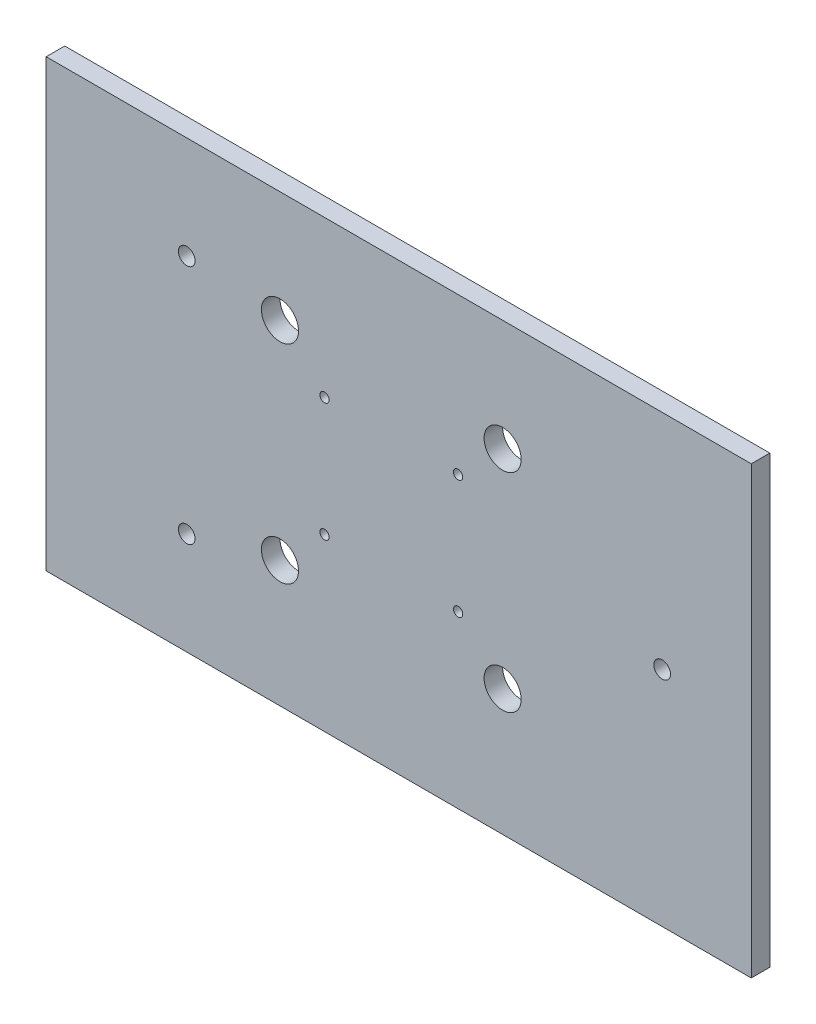
ISO-10303-21;
HEADER;
FILE_DESCRIPTION(('STEP AP214'),'2;1');
FILE_NAME('part.step','',(''),(''),'','','');
FILE_SCHEMA(('AUTOMOTIVE_DESIGN { 1 0 10303 214 1 1 1 1 }'));
ENDSEC;
DATA;
#1=APPLICATION_CONTEXT('core data for automotive mechanical design processes');
#2=APPLICATION_PROTOCOL_DEFINITION('international standard','automotive_design',2000,#1);
#3=PRODUCT_CONTEXT('',#1,'mechanical');
#4=PRODUCT('Part','Part','',(#3));
#5=PRODUCT_RELATED_PRODUCT_CATEGORY('part','',(#4));
#6=PRODUCT_DEFINITION_FORMATION('','',#4);
#7=PRODUCT_DEFINITION_CONTEXT('part definition',#1,'design');
#8=PRODUCT_DEFINITION('design','',#6,#7);
#9=PRODUCT_DEFINITION_SHAPE('','',#8);
#10=(LENGTH_UNIT() NAMED_UNIT(*) SI_UNIT(.MILLI.,.METRE.));
#11=(NAMED_UNIT(*) PLANE_ANGLE_UNIT() SI_UNIT($,.RADIAN.));
#12=(NAMED_UNIT(*) SI_UNIT($,.STERADIAN.) SOLID_ANGLE_UNIT());
#13=UNCERTAINTY_MEASURE_WITH_UNIT(LENGTH_MEASURE(1.E-05),#10,'distance_accuracy_value','');
#14=(GEOMETRIC_REPRESENTATION_CONTEXT(3) GLOBAL_UNCERTAINTY_ASSIGNED_CONTEXT((#13)) GLOBAL_UNIT_ASSIGNED_CONTEXT((#10,
#11,#12)) REPRESENTATION_CONTEXT('',''));
#15=CARTESIAN_POINT('',(0.,0.,0.));
#16=DIRECTION('',(0.,0.,1.));
#17=DIRECTION('',(1.,0.,0.));
#18=AXIS2_PLACEMENT_3D('',#15,#16,#17);
#19=CARTESIAN_POINT('',(0.,0.,5.));
#20=DIRECTION('',(0.,0.,-1.));
#21=DIRECTION('',(-1.,0.,0.));
#22=AXIS2_PLACEMENT_3D('',#19,#20,#21);
#23=PLANE('',#22);
#24=DIRECTION('',(0.,-1.,0.));
#25=VECTOR('',#24,1.);
#26=CARTESIAN_POINT('',(-129.499999999995,92.5000000000001,5.));
#27=LINE('',#26,#25);
#28=CARTESIAN_POINT('',(-129.499999999995,92.5000000000001,5.));
#29=VERTEX_POINT('',#28);
#30=CARTESIAN_POINT('',(-129.499999999995,-27.4999999999999,5.));
#31=VERTEX_POINT('',#30);
#32=EDGE_CURVE('E85',#29,#31,#27,.T.);
#33=ORIENTED_EDGE('',*,*,#32,.T.);
#34=DIRECTION('',(1.,0.,0.));
#35=VECTOR('',#34,1.);
#36=CARTESIAN_POINT('',(60.4999999999949,-27.4999999999992,5.));
#37=LINE('',#36,#35);
#38=CARTESIAN_POINT('',(60.4999999999949,-27.4999999999992,5.));
#39=VERTEX_POINT('',#38);
#40=EDGE_CURVE('E80',#31,#39,#37,.T.);
#41=ORIENTED_EDGE('',*,*,#40,.T.);
#42=DIRECTION('',(0.,1.,0.));
#43=VECTOR('',#42,1.);
#44=CARTESIAN_POINT('',(60.4999999999949,-27.4999999999992,5.));
#45=LINE('',#44,#43);
#46=CARTESIAN_POINT('',(60.4999999999942,92.5000000000007,5.));
#47=VERTEX_POINT('',#46);
#48=EDGE_CURVE('E83',#39,#47,#45,.T.);
#49=ORIENTED_EDGE('',*,*,#48,.T.);
#50=DIRECTION('',(-1.,0.,0.));
#51=VECTOR('',#50,1.);
#52=CARTESIAN_POINT('',(60.4999999999942,92.5000000000007,5.));
#53=LINE('',#52,#51);
#54=EDGE_CURVE('E50',#47,#29,#53,.T.);
#55=ORIENTED_EDGE('',*,*,#54,.T.);
#56=EDGE_LOOP('',(#33,#41,#49,#55));
#57=FACE_BOUND('',#56,.T.);
#58=CARTESIAN_POINT('',(36.4999999999996,32.5000000000007,5.));
#59=DIRECTION('',(0.,0.,1.));
#60=DIRECTION('',(1.,0.,0.));
#61=AXIS2_PLACEMENT_3D('',#58,#59,#60);
#62=CIRCLE('',#61,2.25000000000004);
#63=CARTESIAN_POINT('',(38.7499999999997,32.5000000000007,5.));
#64=VERTEX_POINT('',#63);
#65=EDGE_CURVE('E100',#64,#64,#62,.T.);
#66=ORIENTED_EDGE('',*,*,#65,.F.);
#67=EDGE_LOOP('',(#66));
#68=FACE_BOUND('',#67,.T.);
#69=CARTESIAN_POINT('',(-91.6231990769086,0.0692598560788349,5.));
#70=DIRECTION('',(0.,0.,1.));
#71=DIRECTION('',(1.,0.,0.));
#72=AXIS2_PLACEMENT_3D('',#69,#70,#71);
#73=CIRCLE('',#72,2.2500000000002);
#74=CARTESIAN_POINT('',(-89.3731990769084,0.0692598560788349,5.));
#75=VERTEX_POINT('',#74);
#76=EDGE_CURVE('E115',#75,#75,#73,.T.);
#77=ORIENTED_EDGE('',*,*,#76,.F.);
#78=EDGE_LOOP('',(#77));
#79=FACE_BOUND('',#78,.T.);
#80=CARTESIAN_POINT('',(-91.6231990769086,64.9307401439221,5.));
#81=DIRECTION('',(0.,0.,1.));
#82=DIRECTION('',(1.,0.,0.));
#83=AXIS2_PLACEMENT_3D('',#80,#81,#82);
#84=CIRCLE('',#83,2.24999999999967);
#85=CARTESIAN_POINT('',(-89.3731990769089,64.9307401439221,5.));
#86=VERTEX_POINT('',#85);
#87=EDGE_CURVE('E121',#86,#86,#84,.T.);
#88=ORIENTED_EDGE('',*,*,#87,.F.);
#89=EDGE_LOOP('',(#88));
#90=FACE_BOUND('',#89,.T.);
#91=CARTESIAN_POINT('',(-66.5,62.5,5.));
#92=DIRECTION('',(0.,0.,1.));
#93=DIRECTION('',(1.,0.,0.));
#94=AXIS2_PLACEMENT_3D('',#91,#92,#93);
#95=CIRCLE('',#94,5.);
#96=CARTESIAN_POINT('',(-61.5,62.5,5.));
#97=VERTEX_POINT('',#96);
#98=EDGE_CURVE('E127',#97,#97,#95,.T.);
#99=ORIENTED_EDGE('',*,*,#98,.F.);
#100=EDGE_LOOP('',(#99));
#101=FACE_BOUND('',#100,.T.);
#102=CARTESIAN_POINT('',(-6.5,62.5,5.));
#103=DIRECTION('',(0.,0.,1.));
#104=DIRECTION('',(1.,0.,0.));
#105=AXIS2_PLACEMENT_3D('',#102,#103,#104);
#106=CIRCLE('',#105,5.);
#107=CARTESIAN_POINT('',(-1.5,62.5,5.));
#108=VERTEX_POINT('',#107);
#109=EDGE_CURVE('E133',#108,#108,#106,.T.);
#110=ORIENTED_EDGE('',*,*,#109,.F.);
#111=EDGE_LOOP('',(#110));
#112=FACE_BOUND('',#111,.T.);
#113=CARTESIAN_POINT('',(-6.5,6.5,5.));
#114=DIRECTION('',(0.,0.,1.));
#115=DIRECTION('',(1.,0.,0.));
#116=AXIS2_PLACEMENT_3D('',#113,#114,#115);
#117=CIRCLE('',#116,5.);
#118=CARTESIAN_POINT('',(-1.5,6.5,5.));
#119=VERTEX_POINT('',#118);
#120=EDGE_CURVE('E139',#119,#119,#117,.T.);
#121=ORIENTED_EDGE('',*,*,#120,.F.);
#122=EDGE_LOOP('',(#121));
#123=FACE_BOUND('',#122,.T.);
#124=CARTESIAN_POINT('',(-66.5,6.5,5.));
#125=DIRECTION('',(0.,0.,1.));
#126=DIRECTION('',(1.,0.,0.));
#127=AXIS2_PLACEMENT_3D('',#124,#125,#126);
#128=CIRCLE('',#127,5.);
#129=CARTESIAN_POINT('',(-61.5,6.5,5.));
#130=VERTEX_POINT('',#129);
#131=EDGE_CURVE('E145',#130,#130,#128,.T.);
#132=ORIENTED_EDGE('',*,*,#131,.F.);
#133=EDGE_LOOP('',(#132));
#134=FACE_BOUND('',#133,.T.);
#135=CARTESIAN_POINT('',(-54.5,50.5,5.));
#136=DIRECTION('',(0.,0.,1.));
#137=DIRECTION('',(1.,0.,0.));
#138=AXIS2_PLACEMENT_3D('',#135,#136,#137);
#139=CIRCLE('',#138,1.25);
#140=CARTESIAN_POINT('',(-53.25,50.5,5.));
#141=VERTEX_POINT('',#140);
#142=EDGE_CURVE('E151',#141,#141,#139,.T.);
#143=ORIENTED_EDGE('',*,*,#142,.F.);
#144=EDGE_LOOP('',(#143));
#145=FACE_BOUND('',#144,.T.);
#146=CARTESIAN_POINT('',(-18.5,50.5,5.));
#147=DIRECTION('',(0.,0.,1.));
#148=DIRECTION('',(1.,0.,0.));
#149=AXIS2_PLACEMENT_3D('',#146,#147,#148);
#150=CIRCLE('',#149,1.25);
#151=CARTESIAN_POINT('',(-17.25,50.5,5.));
#152=VERTEX_POINT('',#151);
#153=EDGE_CURVE('E157',#152,#152,#150,.T.);
#154=ORIENTED_EDGE('',*,*,#153,.F.);
#155=EDGE_LOOP('',(#154));
#156=FACE_BOUND('',#155,.T.);
#157=CARTESIAN_POINT('',(-18.5,18.5,5.));
#158=DIRECTION('',(0.,0.,1.));
#159=DIRECTION('',(1.,0.,0.));
#160=AXIS2_PLACEMENT_3D('',#157,#158,#159);
#161=CIRCLE('',#160,1.25);
#162=CARTESIAN_POINT('',(-17.25,18.5,5.));
#163=VERTEX_POINT('',#162);
#164=EDGE_CURVE('E163',#163,#163,#161,.T.);
#165=ORIENTED_EDGE('',*,*,#164,.F.);
#166=EDGE_LOOP('',(#165));
#167=FACE_BOUND('',#166,.T.);
#168=CARTESIAN_POINT('',(-54.5,18.5,5.));
#169=DIRECTION('',(0.,0.,1.));
#170=DIRECTION('',(1.,0.,0.));
#171=AXIS2_PLACEMENT_3D('',#168,#169,#170);
#172=CIRCLE('',#171,1.25);
#173=CARTESIAN_POINT('',(-53.25,18.5,5.));
#174=VERTEX_POINT('',#173);
#175=EDGE_CURVE('E169',#174,#174,#172,.T.);
#176=ORIENTED_EDGE('',*,*,#175,.F.);
#177=EDGE_LOOP('',(#176));
#178=FACE_BOUND('',#177,.T.);
#179=ADVANCED_FACE('F33',(#57,#68,#79,#90,#101,#112,#123,#134,#145,#156,#167,#178),#23,.F.);
#180=CARTESIAN_POINT('',(0.,0.,0.));
#181=DIRECTION('',(0.,0.,-1.));
#182=DIRECTION('',(-1.,0.,0.));
#183=AXIS2_PLACEMENT_3D('',#180,#181,#182);
#184=PLANE('',#183);
#185=CARTESIAN_POINT('',(-18.5,18.5,0.));
#186=DIRECTION('',(0.,0.,1.));
#187=DIRECTION('',(1.,0.,0.));
#188=AXIS2_PLACEMENT_3D('',#185,#186,#187);
#189=CIRCLE('',#188,1.25);
#190=CARTESIAN_POINT('',(-17.25,18.5,0.));
#191=VERTEX_POINT('',#190);
#192=EDGE_CURVE('E166',#191,#191,#189,.T.);
#193=ORIENTED_EDGE('',*,*,#192,.T.);
#194=EDGE_LOOP('',(#193));
#195=FACE_BOUND('',#194,.T.);
#196=CARTESIAN_POINT('',(-54.5,50.5,0.));
#197=DIRECTION('',(0.,0.,1.));
#198=DIRECTION('',(1.,0.,0.));
#199=AXIS2_PLACEMENT_3D('',#196,#197,#198);
#200=CIRCLE('',#199,1.25);
#201=CARTESIAN_POINT('',(-53.25,50.5,0.));
#202=VERTEX_POINT('',#201);
#203=EDGE_CURVE('E154',#202,#202,#200,.T.);
#204=ORIENTED_EDGE('',*,*,#203,.T.);
#205=EDGE_LOOP('',(#204));
#206=FACE_BOUND('',#205,.T.);
#207=CARTESIAN_POINT('',(-6.5,6.5,0.));
#208=DIRECTION('',(0.,0.,1.));
#209=DIRECTION('',(1.,0.,0.));
#210=AXIS2_PLACEMENT_3D('',#207,#208,#209);
#211=CIRCLE('',#210,5.);
#212=CARTESIAN_POINT('',(-1.5,6.5,0.));
#213=VERTEX_POINT('',#212);
#214=EDGE_CURVE('E142',#213,#213,#211,.T.);
#215=ORIENTED_EDGE('',*,*,#214,.T.);
#216=EDGE_LOOP('',(#215));
#217=FACE_BOUND('',#216,.T.);
#218=CARTESIAN_POINT('',(-66.5,62.5,0.));
#219=DIRECTION('',(0.,0.,1.));
#220=DIRECTION('',(1.,0.,0.));
#221=AXIS2_PLACEMENT_3D('',#218,#219,#220);
#222=CIRCLE('',#221,5.);
#223=CARTESIAN_POINT('',(-61.5,62.5,0.));
#224=VERTEX_POINT('',#223);
#225=EDGE_CURVE('E130',#224,#224,#222,.T.);
#226=ORIENTED_EDGE('',*,*,#225,.T.);
#227=EDGE_LOOP('',(#226));
#228=FACE_BOUND('',#227,.T.);
#229=CARTESIAN_POINT('',(-91.6231990769086,0.0692598560788349,0.));
#230=DIRECTION('',(0.,0.,1.));
#231=DIRECTION('',(1.,0.,0.));
#232=AXIS2_PLACEMENT_3D('',#229,#230,#231);
#233=CIRCLE('',#232,2.2500000000002);
#234=CARTESIAN_POINT('',(-89.3731990769084,0.0692598560788349,0.));
#235=VERTEX_POINT('',#234);
#236=EDGE_CURVE('E118',#235,#235,#233,.T.);
#237=ORIENTED_EDGE('',*,*,#236,.T.);
#238=EDGE_LOOP('',(#237));
#239=FACE_BOUND('',#238,.T.);
#240=DIRECTION('',(0.,-1.,0.));
#241=VECTOR('',#240,1.);
#242=CARTESIAN_POINT('',(-129.499999999995,92.5000000000001,0.));
#243=LINE('',#242,#241);
#244=CARTESIAN_POINT('',(-129.499999999995,92.5000000000001,0.));
#245=VERTEX_POINT('',#244);
#246=CARTESIAN_POINT('',(-129.499999999995,-27.4999999999999,0.));
#247=VERTEX_POINT('',#246);
#248=EDGE_CURVE('E97',#245,#247,#243,.T.);
#249=ORIENTED_EDGE('',*,*,#248,.F.);
#250=DIRECTION('',(-1.,0.,0.));
#251=VECTOR('',#250,1.);
#252=CARTESIAN_POINT('',(60.4999999999942,92.5000000000007,0.));
#253=LINE('',#252,#251);
#254=CARTESIAN_POINT('',(60.4999999999942,92.5000000000007,0.));
#255=VERTEX_POINT('',#254);
#256=EDGE_CURVE('E73',#255,#245,#253,.T.);
#257=ORIENTED_EDGE('',*,*,#256,.F.);
#258=DIRECTION('',(0.,1.,0.));
#259=VECTOR('',#258,1.);
#260=CARTESIAN_POINT('',(60.4999999999949,-27.4999999999992,0.));
#261=LINE('',#260,#259);
#262=CARTESIAN_POINT('',(60.4999999999949,-27.4999999999992,0.));
#263=VERTEX_POINT('',#262);
#264=EDGE_CURVE('E67',#263,#255,#261,.T.);
#265=ORIENTED_EDGE('',*,*,#264,.F.);
#266=DIRECTION('',(1.,0.,0.));
#267=VECTOR('',#266,1.);
#268=CARTESIAN_POINT('',(60.4999999999949,-27.4999999999992,0.));
#269=LINE('',#268,#267);
#270=EDGE_CURVE('E89',#247,#263,#269,.T.);
#271=ORIENTED_EDGE('',*,*,#270,.F.);
#272=EDGE_LOOP('',(#249,#257,#265,#271));
#273=FACE_BOUND('',#272,.T.);
#274=CARTESIAN_POINT('',(36.4999999999996,32.5000000000007,0.));
#275=DIRECTION('',(0.,0.,1.));
#276=DIRECTION('',(1.,0.,0.));
#277=AXIS2_PLACEMENT_3D('',#274,#275,#276);
#278=CIRCLE('',#277,2.25000000000004);
#279=CARTESIAN_POINT('',(38.7499999999997,32.5000000000007,0.));
#280=VERTEX_POINT('',#279);
#281=EDGE_CURVE('E112',#280,#280,#278,.T.);
#282=ORIENTED_EDGE('',*,*,#281,.T.);
#283=EDGE_LOOP('',(#282));
#284=FACE_BOUND('',#283,.T.);
#285=CARTESIAN_POINT('',(-91.6231990769086,64.9307401439221,0.));
#286=DIRECTION('',(0.,0.,1.));
#287=DIRECTION('',(1.,0.,0.));
#288=AXIS2_PLACEMENT_3D('',#285,#286,#287);
#289=CIRCLE('',#288,2.24999999999967);
#290=CARTESIAN_POINT('',(-89.3731990769089,64.9307401439221,0.));
#291=VERTEX_POINT('',#290);
#292=EDGE_CURVE('E124',#291,#291,#289,.T.);
#293=ORIENTED_EDGE('',*,*,#292,.T.);
#294=EDGE_LOOP('',(#293));
#295=FACE_BOUND('',#294,.T.);
#296=CARTESIAN_POINT('',(-6.5,62.5,0.));
#297=DIRECTION('',(0.,0.,1.));
#298=DIRECTION('',(1.,0.,0.));
#299=AXIS2_PLACEMENT_3D('',#296,#297,#298);
#300=CIRCLE('',#299,5.);
#301=CARTESIAN_POINT('',(-1.5,62.5,0.));
#302=VERTEX_POINT('',#301);
#303=EDGE_CURVE('E136',#302,#302,#300,.T.);
#304=ORIENTED_EDGE('',*,*,#303,.T.);
#305=EDGE_LOOP('',(#304));
#306=FACE_BOUND('',#305,.T.);
#307=CARTESIAN_POINT('',(-66.5,6.5,0.));
#308=DIRECTION('',(0.,0.,1.));
#309=DIRECTION('',(1.,0.,0.));
#310=AXIS2_PLACEMENT_3D('',#307,#308,#309);
#311=CIRCLE('',#310,5.);
#312=CARTESIAN_POINT('',(-61.5,6.5,0.));
#313=VERTEX_POINT('',#312);
#314=EDGE_CURVE('E148',#313,#313,#311,.T.);
#315=ORIENTED_EDGE('',*,*,#314,.T.);
#316=EDGE_LOOP('',(#315));
#317=FACE_BOUND('',#316,.T.);
#318=CARTESIAN_POINT('',(-18.5,50.5,0.));
#319=DIRECTION('',(0.,0.,1.));
#320=DIRECTION('',(1.,0.,0.));
#321=AXIS2_PLACEMENT_3D('',#318,#319,#320);
#322=CIRCLE('',#321,1.25);
#323=CARTESIAN_POINT('',(-17.25,50.5,0.));
#324=VERTEX_POINT('',#323);
#325=EDGE_CURVE('E160',#324,#324,#322,.T.);
#326=ORIENTED_EDGE('',*,*,#325,.T.);
#327=EDGE_LOOP('',(#326));
#328=FACE_BOUND('',#327,.T.);
#329=CARTESIAN_POINT('',(-54.5,18.5,0.));
#330=DIRECTION('',(0.,0.,1.));
#331=DIRECTION('',(1.,0.,0.));
#332=AXIS2_PLACEMENT_3D('',#329,#330,#331);
#333=CIRCLE('',#332,1.25);
#334=CARTESIAN_POINT('',(-53.25,18.5,0.));
#335=VERTEX_POINT('',#334);
#336=EDGE_CURVE('E172',#335,#335,#333,.T.);
#337=ORIENTED_EDGE('',*,*,#336,.T.);
#338=EDGE_LOOP('',(#337));
#339=FACE_BOUND('',#338,.T.);
#340=ADVANCED_FACE('F108',(#195,#206,#217,#228,#239,#273,#284,#295,#306,#317,#328,#339),#184,.T.);
#341=CARTESIAN_POINT('',(-129.499999999995,92.5000000000001,5.));
#342=DIRECTION('',(1.,0.,0.));
#343=DIRECTION('',(0.,1.,0.));
#344=AXIS2_PLACEMENT_3D('',#341,#342,#343);
#345=PLANE('',#344);
#346=ORIENTED_EDGE('',*,*,#248,.T.);
#347=DIRECTION('',(0.,0.,-1.));
#348=VECTOR('',#347,1.);
#349=CARTESIAN_POINT('',(-129.499999999995,-27.4999999999999,5.));
#350=LINE('',#349,#348);
#351=EDGE_CURVE('E11',#31,#247,#350,.T.);
#352=ORIENTED_EDGE('',*,*,#351,.F.);
#353=ORIENTED_EDGE('',*,*,#32,.F.);
#354=DIRECTION('',(0.,0.,-1.));
#355=VECTOR('',#354,1.);
#356=CARTESIAN_POINT('',(-129.499999999995,92.5000000000001,5.));
#357=LINE('',#356,#355);
#358=EDGE_CURVE('E93',#29,#245,#357,.T.);
#359=ORIENTED_EDGE('',*,*,#358,.T.);
#360=EDGE_LOOP('',(#346,#352,#353,#359));
#361=FACE_BOUND('',#360,.T.);
#362=ADVANCED_FACE('F35',(#361),#345,.F.);
#363=CARTESIAN_POINT('',(60.4999999999949,-27.4999999999992,5.));
#364=DIRECTION('',(0.,1.,0.));
#365=DIRECTION('',(-1.,0.,0.));
#366=AXIS2_PLACEMENT_3D('',#363,#364,#365);
#367=PLANE('',#366);
#368=ORIENTED_EDGE('',*,*,#270,.T.);
#369=DIRECTION('',(0.,0.,-1.));
#370=VECTOR('',#369,1.);
#371=CARTESIAN_POINT('',(60.4999999999949,-27.4999999999992,5.));
#372=LINE('',#371,#370);
#373=EDGE_CURVE('E42',#39,#263,#372,.T.);
#374=ORIENTED_EDGE('',*,*,#373,.F.);
#375=ORIENTED_EDGE('',*,*,#40,.F.);
#376=ORIENTED_EDGE('',*,*,#351,.T.);
#377=EDGE_LOOP('',(#368,#374,#375,#376));
#378=FACE_BOUND('',#377,.T.);
#379=ADVANCED_FACE('F88',(#378),#367,.F.);
#380=CARTESIAN_POINT('',(60.4999999999949,-27.4999999999992,5.));
#381=DIRECTION('',(-1.,0.,0.));
#382=DIRECTION('',(0.,-1.,0.));
#383=AXIS2_PLACEMENT_3D('',#380,#381,#382);
#384=PLANE('',#383);
#385=ORIENTED_EDGE('',*,*,#264,.T.);
#386=DIRECTION('',(0.,0.,-1.));
#387=VECTOR('',#386,1.);
#388=CARTESIAN_POINT('',(60.4999999999942,92.5000000000007,5.));
#389=LINE('',#388,#387);
#390=EDGE_CURVE('E90',#47,#255,#389,.T.);
#391=ORIENTED_EDGE('',*,*,#390,.F.);
#392=ORIENTED_EDGE('',*,*,#48,.F.);
#393=ORIENTED_EDGE('',*,*,#373,.T.);
#394=EDGE_LOOP('',(#385,#391,#392,#393));
#395=FACE_BOUND('',#394,.T.);
#396=ADVANCED_FACE('F91',(#395),#384,.F.);
#397=CARTESIAN_POINT('',(60.4999999999942,92.5000000000007,5.));
#398=DIRECTION('',(0.,-1.,0.));
#399=DIRECTION('',(1.,0.,0.));
#400=AXIS2_PLACEMENT_3D('',#397,#398,#399);
#401=PLANE('',#400);
#402=ORIENTED_EDGE('',*,*,#256,.T.);
#403=ORIENTED_EDGE('',*,*,#358,.F.);
#404=ORIENTED_EDGE('',*,*,#54,.F.);
#405=ORIENTED_EDGE('',*,*,#390,.T.);
#406=EDGE_LOOP('',(#402,#403,#404,#405));
#407=FACE_BOUND('',#406,.T.);
#408=ADVANCED_FACE('F105',(#407),#401,.F.);
#409=CARTESIAN_POINT('',(36.4999999999996,32.5000000000007,5.));
#410=DIRECTION('',(0.,0.,-1.));
#411=DIRECTION('',(-1.,0.,0.));
#412=AXIS2_PLACEMENT_3D('',#409,#410,#411);
#413=CYLINDRICAL_SURFACE('',#412,2.25000000000004);
#414=ORIENTED_EDGE('',*,*,#65,.T.);
#415=EDGE_LOOP('',(#414));
#416=FACE_BOUND('',#415,.T.);
#417=ORIENTED_EDGE('',*,*,#281,.F.);
#418=EDGE_LOOP('',(#417));
#419=FACE_BOUND('',#418,.T.);
#420=ADVANCED_FACE('F189',(#416,#419),#413,.F.);
#421=CARTESIAN_POINT('',(-91.6231990769086,0.0692598560788349,5.));
#422=DIRECTION('',(0.,0.,-1.));
#423=DIRECTION('',(-1.,0.,0.));
#424=AXIS2_PLACEMENT_3D('',#421,#422,#423);
#425=CYLINDRICAL_SURFACE('',#424,2.2500000000002);
#426=ORIENTED_EDGE('',*,*,#76,.T.);
#427=EDGE_LOOP('',(#426));
#428=FACE_BOUND('',#427,.T.);
#429=ORIENTED_EDGE('',*,*,#236,.F.);
#430=EDGE_LOOP('',(#429));
#431=FACE_BOUND('',#430,.T.);
#432=ADVANCED_FACE('F235',(#428,#431),#425,.F.);
#433=CARTESIAN_POINT('',(-91.6231990769086,64.9307401439221,5.));
#434=DIRECTION('',(0.,0.,-1.));
#435=DIRECTION('',(-1.,0.,0.));
#436=AXIS2_PLACEMENT_3D('',#433,#434,#435);
#437=CYLINDRICAL_SURFACE('',#436,2.24999999999967);
#438=ORIENTED_EDGE('',*,*,#87,.T.);
#439=EDGE_LOOP('',(#438));
#440=FACE_BOUND('',#439,.T.);
#441=ORIENTED_EDGE('',*,*,#292,.F.);
#442=EDGE_LOOP('',(#441));
#443=FACE_BOUND('',#442,.T.);
#444=ADVANCED_FACE('F243',(#440,#443),#437,.F.);
#445=CARTESIAN_POINT('',(-66.5,62.5,5.));
#446=DIRECTION('',(0.,0.,-1.));
#447=DIRECTION('',(-1.,0.,0.));
#448=AXIS2_PLACEMENT_3D('',#445,#446,#447);
#449=CYLINDRICAL_SURFACE('',#448,5.);
#450=ORIENTED_EDGE('',*,*,#98,.T.);
#451=EDGE_LOOP('',(#450));
#452=FACE_BOUND('',#451,.T.);
#453=ORIENTED_EDGE('',*,*,#225,.F.);
#454=EDGE_LOOP('',(#453));
#455=FACE_BOUND('',#454,.T.);
#456=ADVANCED_FACE('F251',(#452,#455),#449,.F.);
#457=CARTESIAN_POINT('',(-6.5,62.5,5.));
#458=DIRECTION('',(0.,0.,-1.));
#459=DIRECTION('',(-1.,0.,0.));
#460=AXIS2_PLACEMENT_3D('',#457,#458,#459);
#461=CYLINDRICAL_SURFACE('',#460,5.);
#462=ORIENTED_EDGE('',*,*,#109,.T.);
#463=EDGE_LOOP('',(#462));
#464=FACE_BOUND('',#463,.T.);
#465=ORIENTED_EDGE('',*,*,#303,.F.);
#466=EDGE_LOOP('',(#465));
#467=FACE_BOUND('',#466,.T.);
#468=ADVANCED_FACE('F260',(#464,#467),#461,.F.);
#469=CARTESIAN_POINT('',(-6.5,6.5,5.));
#470=DIRECTION('',(0.,0.,-1.));
#471=DIRECTION('',(-1.,0.,0.));
#472=AXIS2_PLACEMENT_3D('',#469,#470,#471);
#473=CYLINDRICAL_SURFACE('',#472,5.);
#474=ORIENTED_EDGE('',*,*,#120,.T.);
#475=EDGE_LOOP('',(#474));
#476=FACE_BOUND('',#475,.T.);
#477=ORIENTED_EDGE('',*,*,#214,.F.);
#478=EDGE_LOOP('',(#477));
#479=FACE_BOUND('',#478,.T.);
#480=ADVANCED_FACE('F269',(#476,#479),#473,.F.);
#481=CARTESIAN_POINT('',(-66.5,6.5,5.));
#482=DIRECTION('',(0.,0.,-1.));
#483=DIRECTION('',(-1.,0.,0.));
#484=AXIS2_PLACEMENT_3D('',#481,#482,#483);
#485=CYLINDRICAL_SURFACE('',#484,5.);
#486=ORIENTED_EDGE('',*,*,#131,.T.);
#487=EDGE_LOOP('',(#486));
#488=FACE_BOUND('',#487,.T.);
#489=ORIENTED_EDGE('',*,*,#314,.F.);
#490=EDGE_LOOP('',(#489));
#491=FACE_BOUND('',#490,.T.);
#492=ADVANCED_FACE('F278',(#488,#491),#485,.F.);
#493=CARTESIAN_POINT('',(-54.5,50.5,5.));
#494=DIRECTION('',(0.,0.,-1.));
#495=DIRECTION('',(-1.,0.,0.));
#496=AXIS2_PLACEMENT_3D('',#493,#494,#495);
#497=CYLINDRICAL_SURFACE('',#496,1.25);
#498=ORIENTED_EDGE('',*,*,#142,.T.);
#499=EDGE_LOOP('',(#498));
#500=FACE_BOUND('',#499,.T.);
#501=ORIENTED_EDGE('',*,*,#203,.F.);
#502=EDGE_LOOP('',(#501));
#503=FACE_BOUND('',#502,.T.);
#504=ADVANCED_FACE('F287',(#500,#503),#497,.F.);
#505=CARTESIAN_POINT('',(-18.5,50.5,5.));
#506=DIRECTION('',(0.,0.,-1.));
#507=DIRECTION('',(-1.,0.,0.));
#508=AXIS2_PLACEMENT_3D('',#505,#506,#507);
#509=CYLINDRICAL_SURFACE('',#508,1.25);
#510=ORIENTED_EDGE('',*,*,#153,.T.);
#511=EDGE_LOOP('',(#510));
#512=FACE_BOUND('',#511,.T.);
#513=ORIENTED_EDGE('',*,*,#325,.F.);
#514=EDGE_LOOP('',(#513));
#515=FACE_BOUND('',#514,.T.);
#516=ADVANCED_FACE('F296',(#512,#515),#509,.F.);
#517=CARTESIAN_POINT('',(-18.5,18.5,5.));
#518=DIRECTION('',(0.,0.,-1.));
#519=DIRECTION('',(-1.,0.,0.));
#520=AXIS2_PLACEMENT_3D('',#517,#518,#519);
#521=CYLINDRICAL_SURFACE('',#520,1.25);
#522=ORIENTED_EDGE('',*,*,#164,.T.);
#523=EDGE_LOOP('',(#522));
#524=FACE_BOUND('',#523,.T.);
#525=ORIENTED_EDGE('',*,*,#192,.F.);
#526=EDGE_LOOP('',(#525));
#527=FACE_BOUND('',#526,.T.);
#528=ADVANCED_FACE('F305',(#524,#527),#521,.F.);
#529=CARTESIAN_POINT('',(-54.5,18.5,5.));
#530=DIRECTION('',(0.,0.,-1.));
#531=DIRECTION('',(-1.,0.,0.));
#532=AXIS2_PLACEMENT_3D('',#529,#530,#531);
#533=CYLINDRICAL_SURFACE('',#532,1.25);
#534=ORIENTED_EDGE('',*,*,#175,.T.);
#535=EDGE_LOOP('',(#534));
#536=FACE_BOUND('',#535,.T.);
#537=ORIENTED_EDGE('',*,*,#336,.F.);
#538=EDGE_LOOP('',(#537));
#539=FACE_BOUND('',#538,.T.);
#540=ADVANCED_FACE('F178',(#536,#539),#533,.F.);
#541=CLOSED_SHELL('',(#179,#340,#362,#379,#396,#408,#420,#432,#444,#456,#468,#480,#492,#504,
#516,#528,#540));
#542=MANIFOLD_SOLID_BREP('B2',#541);
#543=ADVANCED_BREP_SHAPE_REPRESENTATION('',(#18,#542),#14);
#544=SHAPE_DEFINITION_REPRESENTATION(#9,#543);
ENDSEC;
END-ISO-10303-21;
